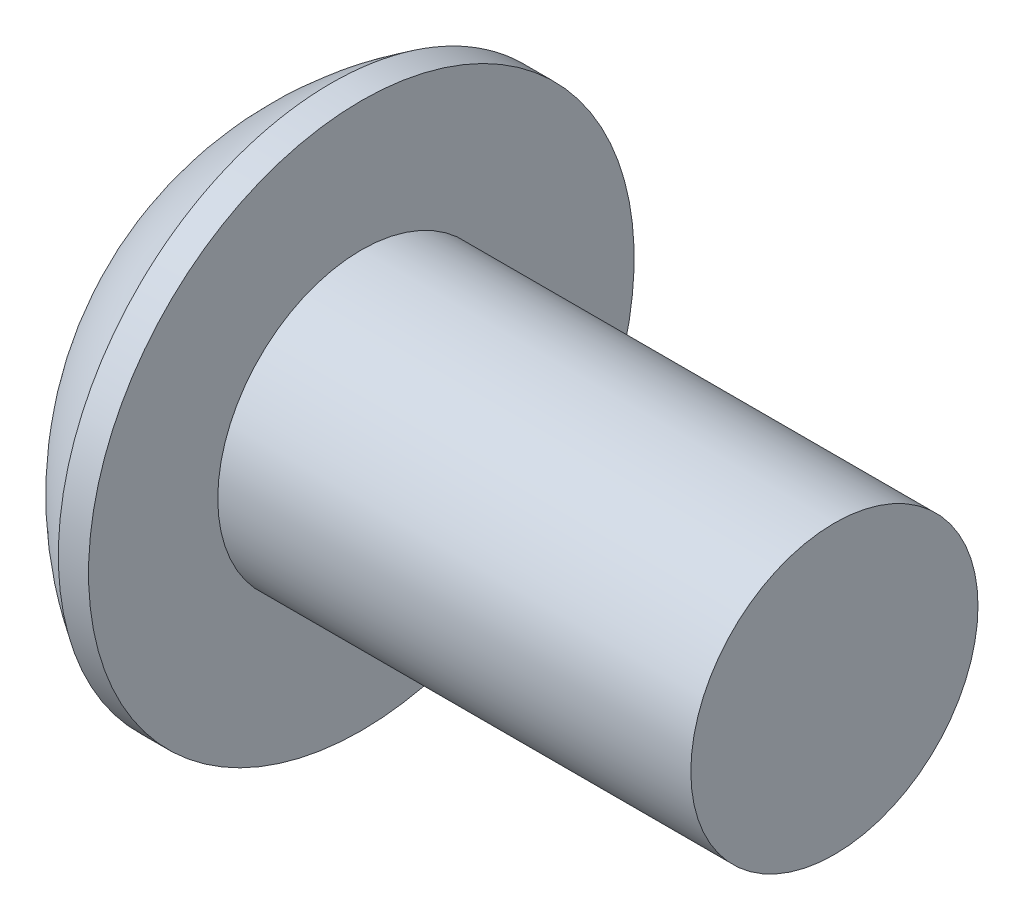
ISO-10303-21;
HEADER;
FILE_DESCRIPTION(('STEP AP214'),'2;1');
FILE_NAME('part.step','',(''),(''),'','','');
FILE_SCHEMA(('AUTOMOTIVE_DESIGN { 1 0 10303 214 1 1 1 1 }'));
ENDSEC;
DATA;
#1=APPLICATION_CONTEXT('core data for automotive mechanical design processes');
#2=APPLICATION_PROTOCOL_DEFINITION('international standard','automotive_design',2000,#1);
#3=PRODUCT_CONTEXT('',#1,'mechanical');
#4=PRODUCT('Part','Part','',(#3));
#5=PRODUCT_RELATED_PRODUCT_CATEGORY('part','',(#4));
#6=PRODUCT_DEFINITION_FORMATION('','',#4);
#7=PRODUCT_DEFINITION_CONTEXT('part definition',#1,'design');
#8=PRODUCT_DEFINITION('design','',#6,#7);
#9=PRODUCT_DEFINITION_SHAPE('','',#8);
#10=(LENGTH_UNIT() NAMED_UNIT(*) SI_UNIT(.MILLI.,.METRE.));
#11=(NAMED_UNIT(*) PLANE_ANGLE_UNIT() SI_UNIT($,.RADIAN.));
#12=(NAMED_UNIT(*) SI_UNIT($,.STERADIAN.) SOLID_ANGLE_UNIT());
#13=UNCERTAINTY_MEASURE_WITH_UNIT(LENGTH_MEASURE(1.E-05),#10,'distance_accuracy_value','');
#14=(GEOMETRIC_REPRESENTATION_CONTEXT(3) GLOBAL_UNCERTAINTY_ASSIGNED_CONTEXT((#13)) GLOBAL_UNIT_ASSIGNED_CONTEXT((#10,
#11,#12)) REPRESENTATION_CONTEXT('',''));
#15=CARTESIAN_POINT('',(0.,0.,0.));
#16=DIRECTION('',(0.,0.,1.));
#17=DIRECTION('',(1.,0.,0.));
#18=AXIS2_PLACEMENT_3D('',#15,#16,#17);
#19=CARTESIAN_POINT('',(-0.533400000000002,0.,0.));
#20=DIRECTION('',(-1.,0.,0.));
#21=DIRECTION('',(0.,0.,1.));
#22=AXIS2_PLACEMENT_3D('',#19,#20,#21);
#23=PLANE('',#22);
#24=DIRECTION('',(0.,0.5,0.866025403784439));
#25=VECTOR('',#24,1.);
#26=CARTESIAN_POINT('',(-0.533400000000002,1.83308710467706,0.));
#27=LINE('',#26,#25);
#28=CARTESIAN_POINT('',(-0.533400000000002,1.83308710467706,0.));
#29=VERTEX_POINT('',#28);
#30=CARTESIAN_POINT('',(-0.533400000000002,0.916543552338531,-1.5875));
#31=VERTEX_POINT('',#30);
#32=EDGE_CURVE('E116',#29,#31,#27,.F.);
#33=ORIENTED_EDGE('',*,*,#32,.T.);
#34=DIRECTION('',(0.,1.,0.));
#35=VECTOR('',#34,1.);
#36=CARTESIAN_POINT('',(-0.533400000000002,0.916543552338531,-1.5875));
#37=LINE('',#36,#35);
#38=CARTESIAN_POINT('',(-0.533400000000002,-0.916543552338531,-1.5875));
#39=VERTEX_POINT('',#38);
#40=EDGE_CURVE('E83',#31,#39,#37,.F.);
#41=ORIENTED_EDGE('',*,*,#40,.T.);
#42=DIRECTION('',(0.,0.5,-0.866025403784439));
#43=VECTOR('',#42,1.);
#44=CARTESIAN_POINT('',(-0.533400000000002,-0.916543552338531,-1.5875));
#45=LINE('',#44,#43);
#46=CARTESIAN_POINT('',(-0.533400000000002,-1.83308710467706,0.));
#47=VERTEX_POINT('',#46);
#48=EDGE_CURVE('E85',#39,#47,#45,.F.);
#49=ORIENTED_EDGE('',*,*,#48,.T.);
#50=DIRECTION('',(0.,-0.5,-0.866025403784439));
#51=VECTOR('',#50,1.);
#52=CARTESIAN_POINT('',(-0.533400000000002,-1.83308710467706,0.));
#53=LINE('',#52,#51);
#54=CARTESIAN_POINT('',(-0.533400000000002,-0.916543552338533,1.5875));
#55=VERTEX_POINT('',#54);
#56=EDGE_CURVE('E86',#47,#55,#53,.F.);
#57=ORIENTED_EDGE('',*,*,#56,.T.);
#58=DIRECTION('',(0.,-1.,0.));
#59=VECTOR('',#58,1.);
#60=CARTESIAN_POINT('',(-0.533400000000002,-0.916543552338532,1.5875));
#61=LINE('',#60,#59);
#62=CARTESIAN_POINT('',(-0.533400000000002,0.916543552338531,1.5875));
#63=VERTEX_POINT('',#62);
#64=EDGE_CURVE('E72',#55,#63,#61,.F.);
#65=ORIENTED_EDGE('',*,*,#64,.T.);
#66=DIRECTION('',(0.,-0.5,0.866025403784439));
#67=VECTOR('',#66,1.);
#68=CARTESIAN_POINT('',(-0.533400000000002,0.916543552338531,1.5875));
#69=LINE('',#68,#67);
#70=EDGE_CURVE('E111',#63,#29,#69,.F.);
#71=ORIENTED_EDGE('',*,*,#70,.T.);
#72=EDGE_LOOP('',(#33,#41,#49,#57,#65,#71));
#73=FACE_BOUND('',#72,.T.);
#74=ADVANCED_FACE('F17',(#73),#23,.T.);
#75=CARTESIAN_POINT('',(-0.533400000000002,-1.83308710467706,0.));
#76=DIRECTION('',(0.,-0.866025403784439,0.5));
#77=DIRECTION('',(0.,-0.5,-0.866025403784439));
#78=AXIS2_PLACEMENT_3D('',#75,#76,#77);
#79=PLANE('',#78);
#80=CARTESIAN_POINT('',(-2.56539999994394,-1.8330871046745,-2.00804498786736E-11));
#81=CARTESIAN_POINT('',(-2.53392818229741,-1.80158505518366,0.0545631502562923));
#82=CARTESIAN_POINT('',(-2.5043050627177,-1.76955629074211,0.110038597579172));
#83=CARTESIAN_POINT('',(-2.45006639539122,-1.70424635317817,0.223158727683824));
#84=CARTESIAN_POINT('',(-2.42548101615987,-1.6709589724711,0.280814162317604));
#85=CARTESIAN_POINT('',(-2.38336609605347,-1.60383660211837,0.397073518091736));
#86=CARTESIAN_POINT('',(-2.36573072948629,-1.57001869730198,0.455647847439699));
#87=CARTESIAN_POINT('',(-2.33856008862263,-1.50163859306838,0.574085662199493));
#88=CARTESIAN_POINT('',(-2.32900454007239,-1.46707848106388,0.633945532106421));
#89=CARTESIAN_POINT('',(-2.32038274183869,-1.40751253669323,0.737116774157155));
#90=CARTESIAN_POINT('',(-2.31910682172836,-1.38258360390154,0.780294952330845));
#91=CARTESIAN_POINT('',(-2.32125913780735,-1.33276652395073,0.866580665890379));
#92=CARTESIAN_POINT('',(-2.32468902284537,-1.30787839414808,0.90968817121394));
#93=CARTESIAN_POINT('',(-2.33605631415915,-1.25834345643267,0.995485200086784));
#94=CARTESIAN_POINT('',(-2.34399762019329,-1.23369687609494,1.03817432946455));
#95=CARTESIAN_POINT('',(-2.36395627681902,-1.18481740842653,1.12283605091316));
#96=CARTESIAN_POINT('',(-2.37597537628367,-1.16058470328902,1.16480832741616));
#97=CARTESIAN_POINT('',(-2.41164383187845,-1.09853862948576,1.27227527965358));
#98=CARTESIAN_POINT('',(-2.43797770752625,-1.06110942924036,1.33710455616529));
#99=CARTESIAN_POINT('',(-2.48243061452926,-1.00607390269188,1.43242888436855));
#100=CARTESIAN_POINT('',(-2.49804835924321,-0.987937988038022,1.46384120999077));
#101=CARTESIAN_POINT('',(-2.53070945051393,-0.951999508520197,1.52608848246242));
#102=CARTESIAN_POINT('',(-2.54775211871235,-0.934196789917587,1.55692369559499));
#103=CARTESIAN_POINT('',(-2.56539999993807,-0.916543552329633,1.58750000001541));
#104=B_SPLINE_CURVE_WITH_KNOTS('',3,(#80,#81,#82,#83,#84,#85,#86,#87,#88,#89,#90,#91,#92,#93,
#94,#95,#96,#97,#98,#99,#100,#101,#102,#103),.UNSPECIFIED.,.F.,.F.,(4,2,2,2,2,2,2,2,2,2,2,4),
(0.,0.211427927732169,0.424087197148228,0.633370156422424,0.842126401515785,0.991537201098734,
1.14100036552056,1.29059292577265,1.44024972414947,1.67781721417335,1.79627069411587,
1.91466809995991),.UNSPECIFIED.);
#105=CARTESIAN_POINT('',(-2.56539999993857,-1.83308710468646,0.));
#106=VERTEX_POINT('',#105);
#107=CARTESIAN_POINT('',(-2.56539999993106,-0.916543552342318,1.5875));
#108=VERTEX_POINT('',#107);
#109=EDGE_CURVE('E20',#106,#108,#104,.T.);
#110=ORIENTED_EDGE('',*,*,#109,.T.);
#111=DIRECTION('',(1.,0.,0.));
#112=VECTOR('',#111,1.);
#113=CARTESIAN_POINT('',(-0.533400000000002,-0.916543552338533,1.5875));
#114=LINE('',#113,#112);
#115=EDGE_CURVE('E91',#108,#55,#114,.T.);
#116=ORIENTED_EDGE('',*,*,#115,.T.);
#117=ORIENTED_EDGE('',*,*,#56,.F.);
#118=DIRECTION('',(1.,0.,0.));
#119=VECTOR('',#118,1.);
#120=CARTESIAN_POINT('',(-0.533400000000002,-1.83308710467706,0.));
#121=LINE('',#120,#119);
#122=EDGE_CURVE('E59',#47,#106,#121,.F.);
#123=ORIENTED_EDGE('',*,*,#122,.T.);
#124=EDGE_LOOP('',(#110,#116,#117,#123));
#125=FACE_BOUND('',#124,.T.);
#126=ADVANCED_FACE('F90',(#125),#79,.F.);
#127=CARTESIAN_POINT('',(-0.533400000000002,-0.916543552338531,-1.5875));
#128=DIRECTION('',(0.,-0.866025403784439,-0.5));
#129=DIRECTION('',(0.,0.5,-0.866025403784439));
#130=AXIS2_PLACEMENT_3D('',#127,#128,#129);
#131=PLANE('',#130);
#132=CARTESIAN_POINT('',(-2.56539999994527,-0.916543552319403,-1.58750000001409));
#133=CARTESIAN_POINT('',(-2.53392818229919,-0.948045601822691,-1.53293684974403));
#134=CARTESIAN_POINT('',(-2.50430506271949,-0.980074366269487,-1.47746140242354));
#135=CARTESIAN_POINT('',(-2.45006639539264,-1.04538430383757,-1.36434127232016));
#136=CARTESIAN_POINT('',(-2.42548101616093,-1.07867168454351,-1.30668583768523));
#137=CARTESIAN_POINT('',(-2.38336609605398,-1.14579405489574,-1.19042648190974));
#138=CARTESIAN_POINT('',(-2.36573072948662,-1.17961195971273,-1.13185215256154));
#139=CARTESIAN_POINT('',(-2.3385600886227,-1.2479920639471,-1.013414337801));
#140=CARTESIAN_POINT('',(-2.32900454007237,-1.28255217595175,-0.953554467893575));
#141=CARTESIAN_POINT('',(-2.32038274183866,-1.34211812032265,-0.850383225842316));
#142=CARTESIAN_POINT('',(-2.31910682172835,-1.36704705311438,-0.807205047668587));
#143=CARTESIAN_POINT('',(-2.32125913780739,-1.41686413306525,-0.720919334108961));
#144=CARTESIAN_POINT('',(-2.32468902284544,-1.44175226286793,-0.67781182878535));
#145=CARTESIAN_POINT('',(-2.33605631415929,-1.49128720058339,-0.592014799912417));
#146=CARTESIAN_POINT('',(-2.34399762019345,-1.51593378092113,-0.54932567053461));
#147=CARTESIAN_POINT('',(-2.36395627681926,-1.56481324858959,-0.464663949085931));
#148=CARTESIAN_POINT('',(-2.37597537628395,-1.58904595372712,-0.422691672582891));
#149=CARTESIAN_POINT('',(-2.41164383187876,-1.65109202753029,-0.315224720345625));
#150=CARTESIAN_POINT('',(-2.43797770752652,-1.6885212277756,-0.250395443834082));
#151=CARTESIAN_POINT('',(-2.48243061452944,-1.74355675432393,-0.15507111563107));
#152=CARTESIAN_POINT('',(-2.49804835924337,-1.76169266897775,-0.123658790008927));
#153=CARTESIAN_POINT('',(-2.53070945051401,-1.79763114849548,-0.0614115175374324));
#154=CARTESIAN_POINT('',(-2.5477521187124,-1.81543386709805,-0.0305763044049344));
#155=CARTESIAN_POINT('',(-2.56539999993807,-1.83308710468596,1.54136844652939E-11));
#156=B_SPLINE_CURVE_WITH_KNOTS('',3,(#132,#133,#134,#135,#136,#137,#138,#139,#140,#141,#142,
#143,#144,#145,#146,#147,#148,#149,#150,#151,#152,#153,#154,#155),.UNSPECIFIED.,.F.,.F.,(4,2,2,
2,2,2,2,2,2,2,2,4),(0.,0.211427927733669,0.424087197151313,0.633370156427101,0.842126401522016,
0.99153720110513,1.14100036552713,1.29059292577937,1.44024972415633,1.67781721417961,
1.79627069412184,1.9146680999656),.UNSPECIFIED.);
#157=CARTESIAN_POINT('',(-2.56539999995198,-0.916543552351339,-1.58750000002218));
#158=VERTEX_POINT('',#157);
#159=EDGE_CURVE('E95',#158,#106,#156,.T.);
#160=ORIENTED_EDGE('',*,*,#159,.T.);
#161=ORIENTED_EDGE('',*,*,#122,.F.);
#162=ORIENTED_EDGE('',*,*,#48,.F.);
#163=DIRECTION('',(-1.,0.,0.));
#164=VECTOR('',#163,1.);
#165=CARTESIAN_POINT('',(-0.533400000000002,-0.916543552338531,-1.5875));
#166=LINE('',#165,#164);
#167=EDGE_CURVE('E97',#39,#158,#166,.T.);
#168=ORIENTED_EDGE('',*,*,#167,.T.);
#169=EDGE_LOOP('',(#160,#161,#162,#168));
#170=FACE_BOUND('',#169,.T.);
#171=ADVANCED_FACE('F93',(#170),#131,.F.);
#172=CARTESIAN_POINT('',(-0.533400000000002,0.916543552338531,-1.5875));
#173=DIRECTION('',(0.,0.,-1.));
#174=DIRECTION('',(-1.,0.,0.));
#175=AXIS2_PLACEMENT_3D('',#172,#173,#174);
#176=PLANE('',#175);
#177=CARTESIAN_POINT('',(-2.56539999994527,0.916543552360294,-1.58749999999048));
#178=CARTESIAN_POINT('',(-2.53392818229821,0.853539453376781,-1.58749999999657));
#179=CARTESIAN_POINT('',(-2.50430506271702,0.789481924500113,-1.58749999999908));
#180=CARTESIAN_POINT('',(-2.45006639538581,0.658862049392287,-1.58750000000093));
#181=CARTESIAN_POINT('',(-2.42548101615122,0.59228728799181,-1.58750000000025));
#182=CARTESIAN_POINT('',(-2.38336609603683,0.458042547310979,-1.58749999999976));
#183=CARTESIAN_POINT('',(-2.36573072946494,0.390406737689213,-1.58749999999994));
#184=CARTESIAN_POINT('',(-2.3385600885904,0.253646529243895,-1.58750000000006));
#185=CARTESIAN_POINT('',(-2.32900454003397,0.184526305245804,-1.58750000000001));
#186=CARTESIAN_POINT('',(-2.32038274178942,0.0653944165301613,-1.58749999999999));
#187=CARTESIAN_POINT('',(-2.31910682167392,0.0155365509618711,-1.5875));
#188=CARTESIAN_POINT('',(-2.3212591377409,-0.0840976089101244,-1.5875));
#189=CARTESIAN_POINT('',(-2.32468902277208,-0.133873868500894,-1.5875));
#190=CARTESIAN_POINT('',(-2.33605631407098,-0.2329437439033,-1.5875));
#191=CARTESIAN_POINT('',(-2.34399762009707,-0.282236904564879,-1.5875));
#192=CARTESIAN_POINT('',(-2.36395627670599,-0.379995839874564,-1.5875));
#193=CARTESIAN_POINT('',(-2.37597537616188,-0.428461250136325,-1.5875));
#194=CARTESIAN_POINT('',(-2.41164383175616,-0.552553397787632,-1.5875));
#195=CARTESIAN_POINT('',(-2.43797770742117,-0.627411798334259,-1.5875));
#196=CARTESIAN_POINT('',(-2.48243061445881,-0.737482851511091,-1.5875));
#197=CARTESIAN_POINT('',(-2.49804835918582,-0.773754680844889,-1.5875));
#198=CARTESIAN_POINT('',(-2.53070945048496,-0.845631639931401,-1.5875));
#199=CARTESIAN_POINT('',(-2.54775211869874,-0.881237077161412,-1.5875));
#200=CARTESIAN_POINT('',(-2.56539999994071,-0.916543552361606,-1.5875));
#201=B_SPLINE_CURVE_WITH_KNOTS('',3,(#177,#178,#179,#180,#181,#182,#183,#184,#185,#186,#187,
#188,#189,#190,#191,#192,#193,#194,#195,#196,#197,#198,#199,#200),.UNSPECIFIED.,.F.,.F.,(4,2,2,
2,2,2,2,2,2,2,2,4),(0.,0.211427927701375,0.424087197086717,0.633370156331471,0.842126401395377,
0.991537200933545,1.14100036531054,1.29059292551773,1.44024972384963,1.677817214047,
1.79627069407681,1.91466810000777),.UNSPECIFIED.);
#202=CARTESIAN_POINT('',(-2.56539999995198,0.916543552337129,-1.58749999999757));
#203=VERTEX_POINT('',#202);
#204=EDGE_CURVE('E203',#203,#158,#201,.T.);
#205=ORIENTED_EDGE('',*,*,#204,.T.);
#206=ORIENTED_EDGE('',*,*,#167,.F.);
#207=ORIENTED_EDGE('',*,*,#40,.F.);
#208=DIRECTION('',(1.,0.,0.));
#209=VECTOR('',#208,1.);
#210=CARTESIAN_POINT('',(-0.533400000000002,0.916543552338531,-1.5875));
#211=LINE('',#210,#209);
#212=EDGE_CURVE('E113',#31,#203,#211,.F.);
#213=ORIENTED_EDGE('',*,*,#212,.T.);
#214=EDGE_LOOP('',(#205,#206,#207,#213));
#215=FACE_BOUND('',#214,.T.);
#216=ADVANCED_FACE('F192',(#215),#176,.F.);
#217=CARTESIAN_POINT('',(-0.533400000000002,1.83308710467706,0.));
#218=DIRECTION('',(0.,0.866025403784439,-0.5));
#219=DIRECTION('',(0.,0.5,0.866025403784439));
#220=AXIS2_PLACEMENT_3D('',#217,#218,#219);
#221=PLANE('',#220);
#222=CARTESIAN_POINT('',(-2.56539999994394,1.8330871046745,2.00800374309997E-11));
#223=CARTESIAN_POINT('',(-2.5339281822974,1.80158505518366,-0.0545631502562965));
#224=CARTESIAN_POINT('',(-2.5043050627177,1.76955629074211,-0.11003859757918));
#225=CARTESIAN_POINT('',(-2.45006639539121,1.70424635317816,-0.22315872768384));
#226=CARTESIAN_POINT('',(-2.42548101615987,1.67095897247109,-0.280814162317626));
#227=CARTESIAN_POINT('',(-2.38336609605347,1.60383660211835,-0.397073518091758));
#228=CARTESIAN_POINT('',(-2.36573072948628,1.57001869730197,-0.455647847439717));
#229=CARTESIAN_POINT('',(-2.33856008862263,1.50163859306837,-0.574085662199503));
#230=CARTESIAN_POINT('',(-2.32900454007239,1.46707848106388,-0.633945532106426));
#231=CARTESIAN_POINT('',(-2.32038274183869,1.40751253669322,-0.737116774157154));
#232=CARTESIAN_POINT('',(-2.31910682172836,1.38258360390154,-0.780294952330843));
#233=CARTESIAN_POINT('',(-2.32125913780735,1.33276652395073,-0.866580665890374));
#234=CARTESIAN_POINT('',(-2.32468902284537,1.30787839414808,-0.909688171213933));
#235=CARTESIAN_POINT('',(-2.33605631415915,1.25834345643267,-0.995485200086777));
#236=CARTESIAN_POINT('',(-2.34399762019328,1.23369687609495,-1.03817432946455));
#237=CARTESIAN_POINT('',(-2.36395627681902,1.18481740842653,-1.12283605091316));
#238=CARTESIAN_POINT('',(-2.37597537628367,1.16058470328902,-1.16480832741616));
#239=CARTESIAN_POINT('',(-2.41164383187872,1.09853862948529,-1.2722752796544));
#240=CARTESIAN_POINT('',(-2.43797770752691,1.06110942923942,-1.33710455616691));
#241=CARTESIAN_POINT('',(-2.48243061453059,1.00607390269029,-1.43242888437131));
#242=CARTESIAN_POINT('',(-2.49804835924479,0.987937988036214,-1.4638412099939));
#243=CARTESIAN_POINT('',(-2.53070945051602,0.951999508517968,-1.52608848246628));
#244=CARTESIAN_POINT('',(-2.54775211871471,0.934196789915152,-1.55692369559921));
#245=CARTESIAN_POINT('',(-2.56539999994071,0.916543552326994,-1.58750000001998));
#246=B_SPLINE_CURVE_WITH_KNOTS('',3,(#222,#223,#224,#225,#226,#227,#228,#229,#230,#231,#232,
#233,#234,#235,#236,#237,#238,#239,#240,#241,#242,#243,#244,#245),.UNSPECIFIED.,.F.,.F.,(4,2,2,
2,2,2,2,2,2,2,2,4),(0.,0.211427927732185,0.424087197148259,0.63337015642244,0.842126401515786,
0.99153720109873,1.14100036552055,1.29059292577265,1.44024972414947,1.67781721417631,
1.7962706941203,1.9146680999658),.UNSPECIFIED.);
#247=CARTESIAN_POINT('',(-2.56539999993857,1.83308710468646,0.));
#248=VERTEX_POINT('',#247);
#249=EDGE_CURVE('E196',#248,#203,#246,.T.);
#250=ORIENTED_EDGE('',*,*,#249,.T.);
#251=ORIENTED_EDGE('',*,*,#212,.F.);
#252=ORIENTED_EDGE('',*,*,#32,.F.);
#253=DIRECTION('',(1.,0.,0.));
#254=VECTOR('',#253,1.);
#255=CARTESIAN_POINT('',(-0.533400000000002,1.83308710467706,0.));
#256=LINE('',#255,#254);
#257=EDGE_CURVE('E108',#29,#248,#256,.F.);
#258=ORIENTED_EDGE('',*,*,#257,.T.);
#259=EDGE_LOOP('',(#250,#251,#252,#258));
#260=FACE_BOUND('',#259,.T.);
#261=ADVANCED_FACE('F188',(#260),#221,.F.);
#262=CARTESIAN_POINT('',(-0.533400000000002,0.916543552338531,1.5875));
#263=DIRECTION('',(0.,0.866025403784439,0.5));
#264=DIRECTION('',(0.,-0.5,0.866025403784439));
#265=AXIS2_PLACEMENT_3D('',#262,#263,#264);
#266=PLANE('',#265);
#267=CARTESIAN_POINT('',(-2.56539999994394,0.91654355231986,1.58750000000782));
#268=CARTESIAN_POINT('',(-2.53392818229741,0.948045601824288,1.5329368497393));
#269=CARTESIAN_POINT('',(-2.5043050627177,0.980074366271431,1.47746140241964));
#270=CARTESIAN_POINT('',(-2.45006639539122,1.04538430383949,1.36434127231737));
#271=CARTESIAN_POINT('',(-2.42548101615987,1.07867168454504,1.30668583768271));
#272=CARTESIAN_POINT('',(-2.38336609605347,1.14579405489669,1.19042648190795));
#273=CARTESIAN_POINT('',(-2.36573072948629,1.17961195971347,1.13185215256022));
#274=CARTESIAN_POINT('',(-2.33856008862263,1.24799206394736,1.01341433780059));
#275=CARTESIAN_POINT('',(-2.32900454007239,1.28255217595174,0.953554467893597));
#276=CARTESIAN_POINT('',(-2.32038274183869,1.34211812032234,0.850383225842832));
#277=CARTESIAN_POINT('',(-2.31910682172836,1.36704705311405,0.807205047669152));
#278=CARTESIAN_POINT('',(-2.32125913780735,1.41686413306487,0.720919334109624));
#279=CARTESIAN_POINT('',(-2.32468902284537,1.44175226286752,0.677811828786061));
#280=CARTESIAN_POINT('',(-2.33605631415915,1.49128720058292,0.592014799913215));
#281=CARTESIAN_POINT('',(-2.34399762019328,1.51593378092065,0.549325670535446));
#282=CARTESIAN_POINT('',(-2.36395627681902,1.56481324858906,0.464663949086841));
#283=CARTESIAN_POINT('',(-2.37597537628367,1.58904595372657,0.422691672583837));
#284=CARTESIAN_POINT('',(-2.41164383187845,1.65109202752983,0.315224720346425));
#285=CARTESIAN_POINT('',(-2.43797770752625,1.68852122777524,0.250395443834706));
#286=CARTESIAN_POINT('',(-2.48243061452926,1.74355675432371,0.155071115631445));
#287=CARTESIAN_POINT('',(-2.49804835924321,1.76169266897757,0.123658790009225));
#288=CARTESIAN_POINT('',(-2.53070945051393,1.7976311484954,0.0614115175375789));
#289=CARTESIAN_POINT('',(-2.54775211871235,1.81543386709801,0.0305763044050067));
#290=CARTESIAN_POINT('',(-2.56539999993807,1.83308710468596,-1.54142580803093E-11));
#291=B_SPLINE_CURVE_WITH_KNOTS('',3,(#267,#268,#269,#270,#271,#272,#273,#274,#275,#276,#277,
#278,#279,#280,#281,#282,#283,#284,#285,#286,#287,#288,#289,#290),.UNSPECIFIED.,.F.,.F.,(4,2,2,
2,2,2,2,2,2,2,2,4),(0.,0.211427927732169,0.424087197148227,0.633370156422423,0.842126401515785,
0.991537201098733,1.14100036552056,1.29059292577265,1.44024972414946,1.67781721417335,
1.79627069411587,1.91466809995991),.UNSPECIFIED.);
#292=CARTESIAN_POINT('',(-2.56539999993857,0.91654355234323,1.58750000000814));
#293=VERTEX_POINT('',#292);
#294=EDGE_CURVE('E169',#293,#248,#291,.T.);
#295=ORIENTED_EDGE('',*,*,#294,.T.);
#296=ORIENTED_EDGE('',*,*,#257,.F.);
#297=ORIENTED_EDGE('',*,*,#70,.F.);
#298=DIRECTION('',(1.,0.,0.));
#299=VECTOR('',#298,1.);
#300=CARTESIAN_POINT('',(-0.533400000000002,0.916543552338531,1.5875));
#301=LINE('',#300,#299);
#302=EDGE_CURVE('E40',#63,#293,#301,.F.);
#303=ORIENTED_EDGE('',*,*,#302,.T.);
#304=EDGE_LOOP('',(#295,#296,#297,#303));
#305=FACE_BOUND('',#304,.T.);
#306=ADVANCED_FACE('F181',(#305),#266,.F.);
#307=CARTESIAN_POINT('',(-0.533400000000002,-0.916543552338532,1.5875));
#308=DIRECTION('',(0.,0.,1.));
#309=DIRECTION('',(0.,-1.,0.));
#310=AXIS2_PLACEMENT_3D('',#307,#308,#309);
#311=PLANE('',#310);
#312=CARTESIAN_POINT('',(-2.56539999994394,-0.916543552354642,1.58749999998774));
#313=CARTESIAN_POINT('',(-2.53392818229741,-0.853539453359365,1.58749999999559));
#314=CARTESIAN_POINT('',(-2.50430506271771,-0.789481924470656,1.58749999999882));
#315=CARTESIAN_POINT('',(-2.45006639539122,-0.658862049338629,1.58750000000119));
#316=CARTESIAN_POINT('',(-2.42548101615988,-0.592287287925995,1.58750000000032));
#317=CARTESIAN_POINT('',(-2.38336609605349,-0.458042547221593,1.58749999999969));
#318=CARTESIAN_POINT('',(-2.36573072948631,-0.390406737588416,1.58749999999992));
#319=CARTESIAN_POINT('',(-2.33856008862266,-0.253646529120892,1.58750000000008));
#320=CARTESIAN_POINT('',(-2.32900454007243,-0.184526305112002,1.58750000000002));
#321=CARTESIAN_POINT('',(-2.32038274183874,-0.0653944163707189,1.58749999999999));
#322=CARTESIAN_POINT('',(-2.31910682172841,-0.0155365507873145,1.5875));
#323=CARTESIAN_POINT('',(-2.32125913780742,0.0840976091143437,1.5875));
#324=CARTESIAN_POINT('',(-2.32468902284545,0.133873868719661,1.5875));
#325=CARTESIAN_POINT('',(-2.33605631415924,0.232943744150505,1.5875));
#326=CARTESIAN_POINT('',(-2.34399762019338,0.282236904825971,1.5875));
#327=CARTESIAN_POINT('',(-2.36395627681913,0.379995840162817,1.5875));
#328=CARTESIAN_POINT('',(-2.37597537628379,0.428461250437851,1.5875));
#329=CARTESIAN_POINT('',(-2.41164383187857,0.552553398044325,1.5875));
#330=CARTESIAN_POINT('',(-2.43797770752636,0.627411798535088,1.5875));
#331=CARTESIAN_POINT('',(-2.48243061452933,0.737482851631955,1.5875));
#332=CARTESIAN_POINT('',(-2.49804835924327,0.773754680939651,1.5875));
#333=CARTESIAN_POINT('',(-2.53070945051396,0.84563163997525,1.5875));
#334=CARTESIAN_POINT('',(-2.54775211871237,0.881237077180446,1.5875));
#335=CARTESIAN_POINT('',(-2.56539999993807,0.91654355235633,1.5875));
#336=B_SPLINE_CURVE_WITH_KNOTS('',3,(#312,#313,#314,#315,#316,#317,#318,#319,#320,#321,#322,
#323,#324,#325,#326,#327,#328,#329,#330,#331,#332,#333,#334,#335),.UNSPECIFIED.,.F.,.F.,(4,2,2,
2,2,2,2,2,2,2,2,4),(0.,0.211427927732202,0.424087197148294,0.633370156422521,0.842126401515914,
0.991537201098908,1.14100036552078,1.29059292577292,1.44024972414978,1.67781721417349,
1.79627069411592,1.91466809995988),.UNSPECIFIED.);
#337=EDGE_CURVE('E160',#108,#293,#336,.T.);
#338=ORIENTED_EDGE('',*,*,#337,.T.);
#339=ORIENTED_EDGE('',*,*,#302,.F.);
#340=ORIENTED_EDGE('',*,*,#64,.F.);
#341=ORIENTED_EDGE('',*,*,#115,.F.);
#342=EDGE_LOOP('',(#338,#339,#340,#341));
#343=FACE_BOUND('',#342,.T.);
#344=ADVANCED_FACE('F177',(#343),#311,.F.);
#345=CARTESIAN_POINT('',(-2.56540000003724,0.,0.));
#346=DIRECTION('',(-1.,0.,0.));
#347=DIRECTION('',(0.,-1.,0.));
#348=AXIS2_PLACEMENT_3D('',#345,#346,#347);
#349=CONICAL_SURFACE('',#348,1.83308710478514,0.78539816351237);
#350=ORIENTED_EDGE('',*,*,#109,.F.);
#351=CARTESIAN_POINT('',(-2.56539999992356,0.,0.));
#352=DIRECTION('',(-1.,0.,0.));
#353=DIRECTION('',(0.,-1.,0.));
#354=AXIS2_PLACEMENT_3D('',#351,#352,#353);
#355=CIRCLE('',#354,1.83308710467145);
#356=EDGE_CURVE('E168',#108,#106,#355,.F.);
#357=ORIENTED_EDGE('',*,*,#356,.F.);
#358=EDGE_LOOP('',(#350,#357));
#359=FACE_BOUND('',#358,.T.);
#360=ADVANCED_FACE('F180',(#359),#349,.F.);
#361=CARTESIAN_POINT('',(-2.56540000003724,0.,0.));
#362=DIRECTION('',(-1.,0.,0.));
#363=DIRECTION('',(0.,-1.,0.));
#364=AXIS2_PLACEMENT_3D('',#361,#362,#363);
#365=CONICAL_SURFACE('',#364,1.83308710478514,0.78539816351237);
#366=ORIENTED_EDGE('',*,*,#159,.F.);
#367=CARTESIAN_POINT('',(-2.56539999992356,0.,0.));
#368=DIRECTION('',(-1.,0.,0.));
#369=DIRECTION('',(0.,-1.,0.));
#370=AXIS2_PLACEMENT_3D('',#367,#368,#369);
#371=CIRCLE('',#370,1.83308710467145);
#372=EDGE_CURVE('E279',#106,#158,#371,.F.);
#373=ORIENTED_EDGE('',*,*,#372,.F.);
#374=EDGE_LOOP('',(#366,#373));
#375=FACE_BOUND('',#374,.T.);
#376=ADVANCED_FACE('F216',(#375),#365,.F.);
#377=CARTESIAN_POINT('',(-2.56540000003724,0.,0.));
#378=DIRECTION('',(-1.,0.,0.));
#379=DIRECTION('',(0.,-1.,0.));
#380=AXIS2_PLACEMENT_3D('',#377,#378,#379);
#381=CONICAL_SURFACE('',#380,1.83308710478514,0.785398163397448);
#382=ORIENTED_EDGE('',*,*,#204,.F.);
#383=CARTESIAN_POINT('',(-2.5653999999804,0.,0.));
#384=DIRECTION('',(-1.,0.,0.));
#385=DIRECTION('',(0.,-1.,0.));
#386=AXIS2_PLACEMENT_3D('',#383,#384,#385);
#387=CIRCLE('',#386,1.83308710472829);
#388=EDGE_CURVE('E276',#158,#203,#387,.F.);
#389=ORIENTED_EDGE('',*,*,#388,.F.);
#390=EDGE_LOOP('',(#382,#389));
#391=FACE_BOUND('',#390,.T.);
#392=ADVANCED_FACE('F212',(#391),#381,.F.);
#393=CARTESIAN_POINT('',(-2.56540000003724,0.,0.));
#394=DIRECTION('',(-1.,0.,0.));
#395=DIRECTION('',(0.,-1.,0.));
#396=AXIS2_PLACEMENT_3D('',#393,#394,#395);
#397=CONICAL_SURFACE('',#396,1.83308710478514,0.78539816351237);
#398=ORIENTED_EDGE('',*,*,#249,.F.);
#399=CARTESIAN_POINT('',(-2.56539999992356,0.,0.));
#400=DIRECTION('',(-1.,0.,0.));
#401=DIRECTION('',(0.,-1.,0.));
#402=AXIS2_PLACEMENT_3D('',#399,#400,#401);
#403=CIRCLE('',#402,1.83308710467145);
#404=EDGE_CURVE('E273',#203,#248,#403,.F.);
#405=ORIENTED_EDGE('',*,*,#404,.F.);
#406=EDGE_LOOP('',(#398,#405));
#407=FACE_BOUND('',#406,.T.);
#408=ADVANCED_FACE('F209',(#407),#397,.F.);
#409=CARTESIAN_POINT('',(-2.56540000003724,0.,0.));
#410=DIRECTION('',(-1.,0.,0.));
#411=DIRECTION('',(0.,-1.,0.));
#412=AXIS2_PLACEMENT_3D('',#409,#410,#411);
#413=CONICAL_SURFACE('',#412,1.83308710478514,0.78539816351237);
#414=ORIENTED_EDGE('',*,*,#294,.F.);
#415=CARTESIAN_POINT('',(-2.56539999992356,0.,0.));
#416=DIRECTION('',(-1.,0.,0.));
#417=DIRECTION('',(0.,-1.,0.));
#418=AXIS2_PLACEMENT_3D('',#415,#416,#417);
#419=CIRCLE('',#418,1.83308710467145);
#420=EDGE_CURVE('E268',#248,#293,#419,.F.);
#421=ORIENTED_EDGE('',*,*,#420,.F.);
#422=EDGE_LOOP('',(#414,#421));
#423=FACE_BOUND('',#422,.T.);
#424=ADVANCED_FACE('F155',(#423),#413,.F.);
#425=CARTESIAN_POINT('',(-2.56540000003724,0.,0.));
#426=DIRECTION('',(-1.,0.,0.));
#427=DIRECTION('',(0.,-1.,0.));
#428=AXIS2_PLACEMENT_3D('',#425,#426,#427);
#429=CONICAL_SURFACE('',#428,1.83308710478514,0.785398163512485);
#430=ORIENTED_EDGE('',*,*,#337,.F.);
#431=CARTESIAN_POINT('',(-2.56539999992356,0.,0.));
#432=DIRECTION('',(-1.,0.,0.));
#433=DIRECTION('',(0.,-1.,0.));
#434=AXIS2_PLACEMENT_3D('',#431,#432,#433);
#435=CIRCLE('',#434,1.83308710467145);
#436=EDGE_CURVE('E140',#293,#108,#435,.F.);
#437=ORIENTED_EDGE('',*,*,#436,.F.);
#438=EDGE_LOOP('',(#430,#437));
#439=FACE_BOUND('',#438,.T.);
#440=ADVANCED_FACE('F150',(#439),#429,.F.);
#441=CARTESIAN_POINT('',(-2.5654,0.,0.));
#442=DIRECTION('',(-1.,0.,0.));
#443=DIRECTION('',(0.,-1.,0.));
#444=AXIS2_PLACEMENT_3D('',#441,#442,#443);
#445=PLANE('',#444);
#446=CARTESIAN_POINT('',(-2.5654,-2.29235000000002,0.));
#447=CARTESIAN_POINT('',(-2.56540000000001,-2.29234961429958,-0.0643619991867162));
#448=CARTESIAN_POINT('',(-2.56540000000002,-2.28963695190109,-0.128735826629366));
#449=CARTESIAN_POINT('',(-2.56539999999999,-2.27880393843649,-0.257038618985287));
#450=CARTESIAN_POINT('',(-2.56539999999995,-2.27068199085128,-0.320967446929163));
#451=CARTESIAN_POINT('',(-2.56540000000006,-2.24906694794257,-0.448021254607718));
#452=CARTESIAN_POINT('',(-2.56540000000021,-2.23556532653462,-0.511144793381861));
#453=CARTESIAN_POINT('',(-2.56539999999979,-2.20328400495645,-0.636065176149322));
#454=CARTESIAN_POINT('',(-2.56539999999921,-2.18450002159115,-0.697860899533935));
#455=CARTESIAN_POINT('',(-2.56539999999869,-2.12048422735804,-0.88032980292775));
#456=CARTESIAN_POINT('',(-2.56539999999995,-2.0675359907946,-0.99839179592812));
#457=CARTESIAN_POINT('',(-2.56540000000006,-1.94254204858674,-1.22393765942148));
#458=CARTESIAN_POINT('',(-2.56539999999891,-1.87049561696644,-1.33142112758208));
#459=CARTESIAN_POINT('',(-2.56539999999932,-1.74974254194881,-1.48237719670935));
#460=CARTESIAN_POINT('',(-2.56539999999982,-1.70734573132302,-1.53101280076738));
#461=CARTESIAN_POINT('',(-2.56540000000018,-1.6186391029153,-1.62450601319185));
#462=CARTESIAN_POINT('',(-2.56540000000005,-1.57233309727313,-1.66936721890417));
#463=CARTESIAN_POINT('',(-2.56539999999995,-1.47608431707234,-1.7550488420402));
#464=CARTESIAN_POINT('',(-2.56539999999999,-1.42613990458995,-1.79586741981512));
#465=CARTESIAN_POINT('',(-2.56540000000002,-1.32299452541252,-1.87315615311523));
#466=CARTESIAN_POINT('',(-2.56540000000001,-1.26979280714188,-1.90962529930697));
#467=CARTESIAN_POINT('',(-2.56539999999999,-1.10588180153953,-2.0120772215109));
#468=CARTESIAN_POINT('',(-2.5654,-0.990764947001321,-2.07119486286667));
#469=CARTESIAN_POINT('',(-2.5654,-0.752302198839727,-2.16922858468856));
#470=CARTESIAN_POINT('',(-2.5654,-0.628956393121269,-2.2081448809145));
#471=CARTESIAN_POINT('',(-2.5654,-0.377466101733277,-2.2647275576592));
#472=CARTESIAN_POINT('',(-2.5654,-0.249321590440388,-2.28239382469379));
#473=CARTESIAN_POINT('',(-2.5654,0.0081143537161001,-2.29595665980956));
#474=CARTESIAN_POINT('',(-2.5654,0.137405786579698,-2.29185322789073));
#475=CARTESIAN_POINT('',(-2.5654,0.393449386933719,-2.2620096240906));
#476=CARTESIAN_POINT('',(-2.5654,0.520201567981077,-2.23626956775766));
#477=CARTESIAN_POINT('',(-2.5654,0.767645294384444,-2.16383549332687));
#478=CARTESIAN_POINT('',(-2.5654,0.888336774993549,-2.11714125142686));
#479=CARTESIAN_POINT('',(-2.5654,1.06210572146655,-2.03247976453654));
#480=CARTESIAN_POINT('',(-2.5654,1.11884498714066,-2.00180278323696));
#481=CARTESIAN_POINT('',(-2.5654,1.22954062855572,-1.93578011658036));
#482=CARTESIAN_POINT('',(-2.5654,1.28349764565392,-1.9004355139425));
#483=CARTESIAN_POINT('',(-2.5654,1.38821676641537,-1.82534174602348));
#484=CARTESIAN_POINT('',(-2.5654,1.43898030563028,-1.78559458231503));
#485=CARTESIAN_POINT('',(-2.5654,1.53701984534431,-1.70193996292362));
#486=CARTESIAN_POINT('',(-2.5654,1.5842924328055,-1.65802852924127));
#487=CARTESIAN_POINT('',(-2.5654,1.72023903553758,-1.52059650554139));
#488=CARTESIAN_POINT('',(-2.5654,1.80318066138239,-1.42127847626519));
#489=CARTESIAN_POINT('',(-2.5654,1.95118232345098,-1.21011519784664));
#490=CARTESIAN_POINT('',(-2.5654,2.01624303935584,-1.09827042509272));
#491=CARTESIAN_POINT('',(-2.5654,2.09907772661314,-0.923538238005839));
#492=CARTESIAN_POINT('',(-2.5654,2.12425103063558,-0.864058373981966));
#493=CARTESIAN_POINT('',(-2.5654,2.16947990046565,-0.743221562175601));
#494=CARTESIAN_POINT('',(-2.5654,2.18953960800684,-0.681866178863365));
#495=CARTESIAN_POINT('',(-2.5654,2.22438542051156,-0.557786972400356));
#496=CARTESIAN_POINT('',(-2.5654,2.23917985294818,-0.495065478128172));
#497=CARTESIAN_POINT('',(-2.5654,2.26343456384453,-0.368611258323514));
#498=CARTESIAN_POINT('',(-2.5654,2.27289641559285,-0.304878836759566));
#499=CARTESIAN_POINT('',(-2.5654,2.28388649696736,-0.200873029360621));
#500=CARTESIAN_POINT('',(-2.5654,2.28705930623293,-0.160766164180096));
#501=CARTESIAN_POINT('',(-2.5654,2.29129117827044,-0.0804410725432706));
#502=CARTESIAN_POINT('',(-2.5654,2.29235024104238,-0.0402228460869715));
#503=CARTESIAN_POINT('',(-2.56540000000001,2.29234961429956,0.0643619991867166));
#504=CARTESIAN_POINT('',(-2.56540000000002,2.28963695190107,0.128735826629366));
#505=CARTESIAN_POINT('',(-2.56539999999999,2.27880393843648,0.257038618985288));
#506=CARTESIAN_POINT('',(-2.56539999999995,2.27068199085126,0.320967446929163));
#507=CARTESIAN_POINT('',(-2.56540000000006,2.24906694794255,0.448021254607719));
#508=CARTESIAN_POINT('',(-2.56540000000021,2.2355653265346,0.511144793381862));
#509=CARTESIAN_POINT('',(-2.56539999999979,2.20328400495644,0.636065176149322));
#510=CARTESIAN_POINT('',(-2.56539999999921,2.18450002159113,0.697860899533936));
#511=CARTESIAN_POINT('',(-2.56539999999869,2.12048422735802,0.88032980292775));
#512=CARTESIAN_POINT('',(-2.56539999999995,2.06753599079459,0.998391795928119));
#513=CARTESIAN_POINT('',(-2.56540000000006,1.94254204858672,1.22393765942147));
#514=CARTESIAN_POINT('',(-2.56539999999891,1.87049561696642,1.33142112758208));
#515=CARTESIAN_POINT('',(-2.56539999999933,1.7497425419488,1.48237719670935));
#516=CARTESIAN_POINT('',(-2.56539999999982,1.707345731323,1.53101280076738));
#517=CARTESIAN_POINT('',(-2.56540000000018,1.61863910291529,1.62450601319185));
#518=CARTESIAN_POINT('',(-2.56540000000005,1.57233309727312,1.66936721890418));
#519=CARTESIAN_POINT('',(-2.56539999999995,1.47608431707233,1.75504884204021));
#520=CARTESIAN_POINT('',(-2.56539999999999,1.42613990458993,1.79586741981512));
#521=CARTESIAN_POINT('',(-2.56540000000002,1.3229945254125,1.87315615311523));
#522=CARTESIAN_POINT('',(-2.56540000000001,1.26979280714187,1.90962529930697));
#523=CARTESIAN_POINT('',(-2.56539999999999,1.10588180153952,2.0120772215109));
#524=CARTESIAN_POINT('',(-2.5654,0.990764947001304,2.07119486286667));
#525=CARTESIAN_POINT('',(-2.5654,0.75230219883971,2.16922858468856));
#526=CARTESIAN_POINT('',(-2.5654,0.628956393121252,2.2081448809145));
#527=CARTESIAN_POINT('',(-2.5654,0.377466101733262,2.2647275576592));
#528=CARTESIAN_POINT('',(-2.5654,0.249321590440372,2.28239382469379));
#529=CARTESIAN_POINT('',(-2.5654,-0.00811435371611611,2.29595665980955));
#530=CARTESIAN_POINT('',(-2.5654,-0.137405786579714,2.29185322789072));
#531=CARTESIAN_POINT('',(-2.5654,-0.393449386933735,2.2620096240906));
#532=CARTESIAN_POINT('',(-2.5654,-0.520201567981094,2.23626956775766));
#533=CARTESIAN_POINT('',(-2.5654,-0.767645294384462,2.16383549332688));
#534=CARTESIAN_POINT('',(-2.5654,-0.888336774993567,2.11714125142686));
#535=CARTESIAN_POINT('',(-2.5654,-1.06210572146657,2.03247976453654));
#536=CARTESIAN_POINT('',(-2.5654,-1.11884498714068,2.00180278323695));
#537=CARTESIAN_POINT('',(-2.5654,-1.22954062855574,1.93578011658036));
#538=CARTESIAN_POINT('',(-2.5654,-1.28349764565394,1.9004355139425));
#539=CARTESIAN_POINT('',(-2.5654,-1.38821676641539,1.82534174602348));
#540=CARTESIAN_POINT('',(-2.5654,-1.4389803056303,1.78559458231503));
#541=CARTESIAN_POINT('',(-2.5654,-1.53701984534432,1.70193996292362));
#542=CARTESIAN_POINT('',(-2.5654,-1.58429243280552,1.65802852924127));
#543=CARTESIAN_POINT('',(-2.5654,-1.7202390355376,1.52059650554139));
#544=CARTESIAN_POINT('',(-2.5654,-1.8031806613824,1.42127847626519));
#545=CARTESIAN_POINT('',(-2.5654,-1.951182323451,1.21011519784664));
#546=CARTESIAN_POINT('',(-2.5654,-2.01624303935586,1.09827042509272));
#547=CARTESIAN_POINT('',(-2.5654,-2.09907772661316,0.923538238005837));
#548=CARTESIAN_POINT('',(-2.5654,-2.1242510306356,0.864058373981964));
#549=CARTESIAN_POINT('',(-2.5654,-2.16947990046567,0.743221562175599));
#550=CARTESIAN_POINT('',(-2.5654,-2.18953960800686,0.681866178863365));
#551=CARTESIAN_POINT('',(-2.5654,-2.22438542051158,0.557786972400357));
#552=CARTESIAN_POINT('',(-2.5654,-2.2391798529482,0.495065478128172));
#553=CARTESIAN_POINT('',(-2.5654,-2.26343456384455,0.368611258323514));
#554=CARTESIAN_POINT('',(-2.5654,-2.27289641559287,0.304878836759567));
#555=CARTESIAN_POINT('',(-2.5654,-2.28388649696738,0.200873029360623));
#556=CARTESIAN_POINT('',(-2.5654,-2.28705930623295,0.160766164180096));
#557=CARTESIAN_POINT('',(-2.5654,-2.29129117827046,0.080441072543271));
#558=CARTESIAN_POINT('',(-2.5654,-2.29235024104239,0.0402228460869719));
#559=CARTESIAN_POINT('',(-2.5654,-2.29235000000002,0.));
#560=B_SPLINE_CURVE_WITH_KNOTS('',3,(#446,#447,#448,#449,#450,#451,#452,#453,#454,#455,#456,
#457,#458,#459,#460,#461,#462,#463,#464,#465,#466,#467,#468,#469,#470,#471,#472,#473,#474,#475,
#476,#477,#478,#479,#480,#481,#482,#483,#484,#485,#486,#487,#488,#489,#490,#491,#492,#493,#494,
#495,#496,#497,#498,#499,#500,#501,#502,#503,#504,#505,#506,#507,#508,#509,#510,#511,#512,#513,
#514,#515,#516,#517,#518,#519,#520,#521,#522,#523,#524,#525,#526,#527,#528,#529,#530,#531,#532,
#533,#534,#535,#536,#537,#538,#539,#540,#541,#542,#543,#544,#545,#546,#547,#548,#549,#550,#551,
#552,#553,#554,#555,#556,#557,#558,#559),.UNSPECIFIED.,.T.,.F.,(4,2,2,2,2,2,2,2,2,2,2,2,2,2,2,2,
2,2,2,2,2,2,2,2,2,2,2,2,2,2,2,2,2,2,2,2,2,2,2,2,2,2,2,2,2,2,2,2,2,2,2,2,2,2,2,2,4),(0.,
0.193048968618034,0.386154939782395,0.579568183995959,0.77313871149104,1.15935703864578,
1.54559004914645,1.73895960916369,1.93214273180064,2.12541336477222,2.31872876140889,
2.70495649282619,3.09118009906583,3.47740576789432,3.86363143672286,4.24985504296255,
4.6360827743798,4.82939817101621,5.02266880398749,5.21585192662421,5.40922148664123,
5.79545449714218,6.18167282429725,6.37524335179263,6.56865659600643,6.7617625671709,
6.9548115357891,7.07545693291923,7.19610233004938,7.38915129866742,7.58225726983178,
7.77567051404534,7.96924104154042,8.35545936869516,8.74169237919583,8.93506193921307,
9.12824506185002,9.3215156948216,9.51483109145827,9.90105882287557,10.2872824291152,
10.6735080979437,11.0597337667722,11.4459573730119,11.8321851044292,12.0255005010656,
12.2187711340369,12.4119542566736,12.6053238166906,12.9915568271916,13.3777751543466,
13.571345681842,13.7647589260558,13.9578648972203,14.1509138658385,14.2715592629686,
14.3922046600988),.UNSPECIFIED.);
#561=CARTESIAN_POINT('',(-2.5654,-2.29235000000002,0.));
#562=VERTEX_POINT('',#561);
#563=EDGE_CURVE('E132',#562,#562,#560,.T.);
#564=ORIENTED_EDGE('',*,*,#563,.F.);
#565=EDGE_LOOP('',(#564));
#566=FACE_BOUND('',#565,.T.);
#567=ORIENTED_EDGE('',*,*,#420,.T.);
#568=ORIENTED_EDGE('',*,*,#436,.T.);
#569=ORIENTED_EDGE('',*,*,#356,.T.);
#570=ORIENTED_EDGE('',*,*,#372,.T.);
#571=ORIENTED_EDGE('',*,*,#388,.T.);
#572=ORIENTED_EDGE('',*,*,#404,.T.);
#573=EDGE_LOOP('',(#567,#568,#569,#570,#571,#572));
#574=FACE_BOUND('',#573,.T.);
#575=ADVANCED_FACE('F146',(#566,#574),#445,.T.);
#576=CARTESIAN_POINT('',(2.29449606481481,0.,0.));
#577=DIRECTION('',(0.,1.,0.));
#578=DIRECTION('',(-1.,0.,0.));
#579=AXIS2_PLACEMENT_3D('',#576,#577,#578);
#580=SPHERICAL_SURFACE('',#579,5.37340285883187);
#581=ORIENTED_EDGE('',*,*,#563,.T.);
#582=EDGE_LOOP('',(#581));
#583=FACE_BOUND('',#582,.T.);
#584=CARTESIAN_POINT('',(-0.508,0.,0.));
#585=DIRECTION('',(1.,0.,0.));
#586=DIRECTION('',(0.,1.,0.));
#587=AXIS2_PLACEMENT_3D('',#584,#585,#586);
#588=CIRCLE('',#587,4.5847);
#589=CARTESIAN_POINT('',(-0.508,4.5847,0.));
#590=VERTEX_POINT('',#589);
#591=EDGE_CURVE('E129',#590,#590,#588,.T.);
#592=ORIENTED_EDGE('',*,*,#591,.F.);
#593=EDGE_LOOP('',(#592));
#594=FACE_BOUND('',#593,.T.);
#595=ADVANCED_FACE('F142',(#583,#594),#580,.T.);
#596=CARTESIAN_POINT('',(0.,0.,0.));
#597=DIRECTION('',(1.,0.,0.));
#598=DIRECTION('',(0.,1.,0.));
#599=AXIS2_PLACEMENT_3D('',#596,#597,#598);
#600=CYLINDRICAL_SURFACE('',#599,4.5847);
#601=ORIENTED_EDGE('',*,*,#591,.T.);
#602=EDGE_LOOP('',(#601));
#603=FACE_BOUND('',#602,.T.);
#604=CARTESIAN_POINT('',(0.,0.,0.));
#605=DIRECTION('',(1.,0.,0.));
#606=DIRECTION('',(0.,1.,0.));
#607=AXIS2_PLACEMENT_3D('',#604,#605,#606);
#608=CIRCLE('',#607,4.5847);
#609=CARTESIAN_POINT('',(0.,4.5847,0.));
#610=VERTEX_POINT('',#609);
#611=EDGE_CURVE('E126',#610,#610,#608,.T.);
#612=ORIENTED_EDGE('',*,*,#611,.F.);
#613=EDGE_LOOP('',(#612));
#614=FACE_BOUND('',#613,.T.);
#615=ADVANCED_FACE('F247',(#603,#614),#600,.T.);
#616=CARTESIAN_POINT('',(7.9502,0.,0.));
#617=DIRECTION('',(1.,0.,0.));
#618=DIRECTION('',(0.,1.,0.));
#619=AXIS2_PLACEMENT_3D('',#616,#617,#618);
#620=PLANE('',#619);
#621=CARTESIAN_POINT('',(7.9502,0.,0.));
#622=DIRECTION('',(-1.,0.,0.));
#623=DIRECTION('',(0.,-1.,0.));
#624=AXIS2_PLACEMENT_3D('',#621,#622,#623);
#625=CIRCLE('',#624,2.413);
#626=CARTESIAN_POINT('',(7.9502,-2.413,0.));
#627=VERTEX_POINT('',#626);
#628=EDGE_CURVE('E31',#627,#627,#625,.T.);
#629=ORIENTED_EDGE('',*,*,#628,.F.);
#630=EDGE_LOOP('',(#629));
#631=FACE_BOUND('',#630,.T.);
#632=ADVANCED_FACE('F241',(#631),#620,.T.);
#633=CARTESIAN_POINT('',(0.,4.5847,0.));
#634=DIRECTION('',(1.,0.,0.));
#635=DIRECTION('',(0.,1.,0.));
#636=AXIS2_PLACEMENT_3D('',#633,#634,#635);
#637=PLANE('',#636);
#638=CARTESIAN_POINT('',(0.,0.,0.));
#639=DIRECTION('',(-1.,0.,0.));
#640=DIRECTION('',(0.,-1.,0.));
#641=AXIS2_PLACEMENT_3D('',#638,#639,#640);
#642=CIRCLE('',#641,2.413);
#643=CARTESIAN_POINT('',(0.,-2.413,0.));
#644=VERTEX_POINT('',#643);
#645=EDGE_CURVE('E11',#644,#644,#642,.F.);
#646=ORIENTED_EDGE('',*,*,#645,.F.);
#647=EDGE_LOOP('',(#646));
#648=FACE_BOUND('',#647,.T.);
#649=ORIENTED_EDGE('',*,*,#611,.T.);
#650=EDGE_LOOP('',(#649));
#651=FACE_BOUND('',#650,.T.);
#652=ADVANCED_FACE('F235',(#648,#651),#637,.T.);
#653=CARTESIAN_POINT('',(7.9502,0.,0.));
#654=DIRECTION('',(-1.,0.,0.));
#655=DIRECTION('',(0.,-1.,0.));
#656=AXIS2_PLACEMENT_3D('',#653,#654,#655);
#657=CYLINDRICAL_SURFACE('',#656,2.413);
#658=ORIENTED_EDGE('',*,*,#628,.T.);
#659=EDGE_LOOP('',(#658));
#660=FACE_BOUND('',#659,.T.);
#661=ORIENTED_EDGE('',*,*,#645,.T.);
#662=EDGE_LOOP('',(#661));
#663=FACE_BOUND('',#662,.T.);
#664=ADVANCED_FACE('F233',(#660,#663),#657,.T.);
#665=CLOSED_SHELL('',(#74,#126,#171,#216,#261,#306,#344,#360,#376,#392,#408,#424,#440,#575,#595,
#615,#632,#652,#664));
#666=MANIFOLD_SOLID_BREP('B1',#665);
#667=ADVANCED_BREP_SHAPE_REPRESENTATION('',(#18,#666),#14);
#668=SHAPE_DEFINITION_REPRESENTATION(#9,#667);
ENDSEC;
END-ISO-10303-21;
